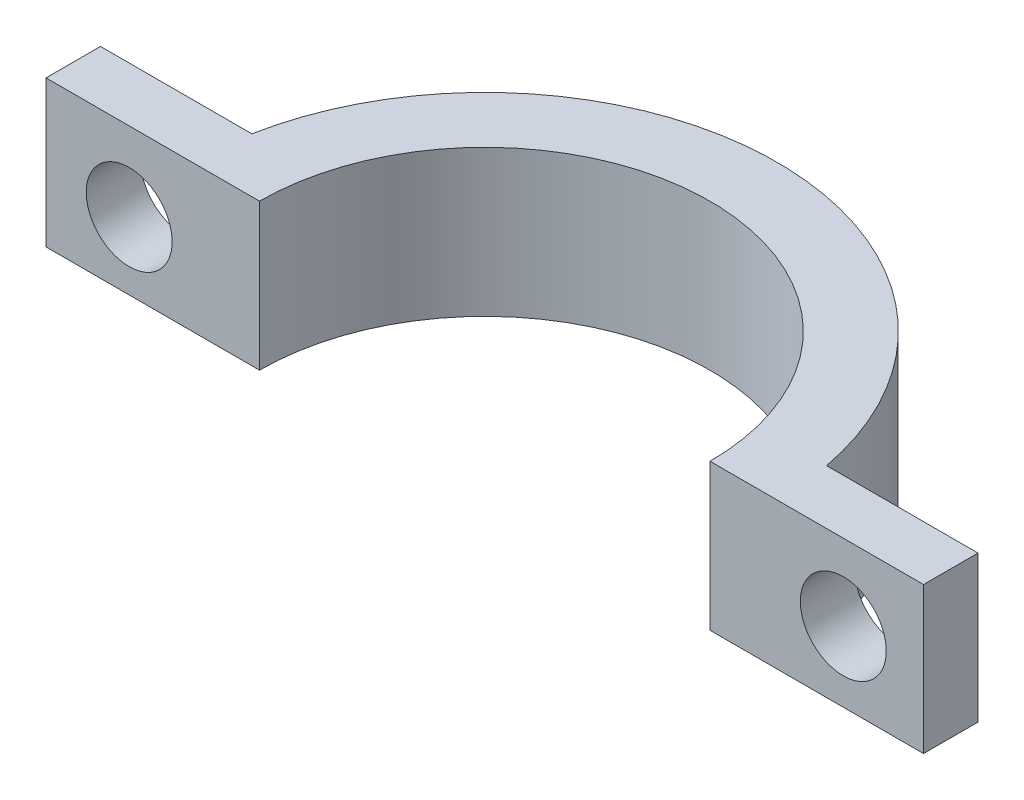
ISO-10303-21;
HEADER;
FILE_DESCRIPTION(('STEP AP214'),'2;1');
FILE_NAME('part.step','',(''),(''),'','','');
FILE_SCHEMA(('AUTOMOTIVE_DESIGN { 1 0 10303 214 1 1 1 1 }'));
ENDSEC;
DATA;
#1=APPLICATION_CONTEXT('core data for automotive mechanical design processes');
#2=APPLICATION_PROTOCOL_DEFINITION('international standard','automotive_design',2000,#1);
#3=PRODUCT_CONTEXT('',#1,'mechanical');
#4=PRODUCT('Part','Part','',(#3));
#5=PRODUCT_RELATED_PRODUCT_CATEGORY('part','',(#4));
#6=PRODUCT_DEFINITION_FORMATION('','',#4);
#7=PRODUCT_DEFINITION_CONTEXT('part definition',#1,'design');
#8=PRODUCT_DEFINITION('design','',#6,#7);
#9=PRODUCT_DEFINITION_SHAPE('','',#8);
#10=(LENGTH_UNIT() NAMED_UNIT(*) SI_UNIT(.MILLI.,.METRE.));
#11=(NAMED_UNIT(*) PLANE_ANGLE_UNIT() SI_UNIT($,.RADIAN.));
#12=(NAMED_UNIT(*) SI_UNIT($,.STERADIAN.) SOLID_ANGLE_UNIT());
#13=UNCERTAINTY_MEASURE_WITH_UNIT(LENGTH_MEASURE(1.E-05),#10,'distance_accuracy_value','');
#14=(GEOMETRIC_REPRESENTATION_CONTEXT(3) GLOBAL_UNCERTAINTY_ASSIGNED_CONTEXT((#13)) GLOBAL_UNIT_ASSIGNED_CONTEXT((#10,
#11,#12)) REPRESENTATION_CONTEXT('',''));
#15=CARTESIAN_POINT('',(0.,0.,0.));
#16=DIRECTION('',(0.,0.,1.));
#17=DIRECTION('',(1.,0.,0.));
#18=AXIS2_PLACEMENT_3D('',#15,#16,#17);
#19=CARTESIAN_POINT('',(0.,13.,-6.68253351351916));
#20=DIRECTION('',(0.,0.,1.));
#21=DIRECTION('',(1.,0.,0.));
#22=AXIS2_PLACEMENT_3D('',#19,#20,#21);
#23=PLANE('',#22);
#24=CARTESIAN_POINT('',(31.8343552375313,6.23079263332781,-6.68253351351916));
#25=DIRECTION('',(0.,0.,-1.));
#26=DIRECTION('',(-1.,0.,0.));
#27=AXIS2_PLACEMENT_3D('',#24,#25,#26);
#28=CIRCLE('',#27,3.81432266995538);
#29=CARTESIAN_POINT('',(28.020032567576,6.23079263332781,-6.68253351351916));
#30=VERTEX_POINT('',#29);
#31=EDGE_CURVE('E174',#30,#30,#28,.T.);
#32=ORIENTED_EDGE('',*,*,#31,.F.);
#33=EDGE_LOOP('',(#32));
#34=FACE_BOUND('',#33,.T.);
#35=DIRECTION('',(-1.,0.,0.));
#36=VECTOR('',#35,1.);
#37=CARTESIAN_POINT('',(0.,0.,-6.68253351351916));
#38=LINE('',#37,#36);
#39=CARTESIAN_POINT('',(38.9573112724548,0.,-6.68253351351922));
#40=VERTEX_POINT('',#39);
#41=CARTESIAN_POINT('',(25.5153185359838,0.,-6.68253351351921));
#42=VERTEX_POINT('',#41);
#43=EDGE_CURVE('E137',#40,#42,#38,.T.);
#44=ORIENTED_EDGE('',*,*,#43,.T.);
#45=DIRECTION('',(0.,-1.,0.));
#46=VECTOR('',#45,1.);
#47=CARTESIAN_POINT('',(25.5153185359838,13.,-6.68253351351921));
#48=LINE('',#47,#46);
#49=CARTESIAN_POINT('',(25.5153185359838,13.,-6.68253351351921));
#50=VERTEX_POINT('',#49);
#51=EDGE_CURVE('E11',#50,#42,#48,.T.);
#52=ORIENTED_EDGE('',*,*,#51,.F.);
#53=DIRECTION('',(-1.,0.,0.));
#54=VECTOR('',#53,1.);
#55=CARTESIAN_POINT('',(0.,13.,-6.68253351351916));
#56=LINE('',#55,#54);
#57=CARTESIAN_POINT('',(38.9573112724548,13.,-6.68253351351922));
#58=VERTEX_POINT('',#57);
#59=EDGE_CURVE('E156',#58,#50,#56,.T.);
#60=ORIENTED_EDGE('',*,*,#59,.F.);
#61=DIRECTION('',(0.,-1.,0.));
#62=VECTOR('',#61,1.);
#63=CARTESIAN_POINT('',(38.9573112724548,13.,-6.68253351351922));
#64=LINE('',#63,#62);
#65=EDGE_CURVE('E56',#58,#40,#64,.T.);
#66=ORIENTED_EDGE('',*,*,#65,.T.);
#67=EDGE_LOOP('',(#44,#52,#60,#66));
#68=FACE_BOUND('',#67,.T.);
#69=ADVANCED_FACE('F38',(#34,#68),#23,.F.);
#70=CARTESIAN_POINT('',(3.5527136788005E-12,13.,-1.84551397913424));
#71=DIRECTION('',(0.,-1.,0.));
#72=DIRECTION('',(0.,0.,-1.));
#73=AXIS2_PLACEMENT_3D('',#70,#71,#72);
#74=CYLINDRICAL_SURFACE('',#73,25.9697562169644);
#75=CARTESIAN_POINT('',(3.5527136788005E-12,0.,-1.84551397913424));
#76=DIRECTION('',(0.,1.,0.));
#77=DIRECTION('',(0.,0.,1.));
#78=AXIS2_PLACEMENT_3D('',#75,#76,#77);
#79=CIRCLE('',#78,25.9697562169644);
#80=CARTESIAN_POINT('',(-25.5153185359768,0.,-6.68253351351921));
#81=VERTEX_POINT('',#80);
#82=EDGE_CURVE('E139',#42,#81,#79,.T.);
#83=ORIENTED_EDGE('',*,*,#82,.T.);
#84=DIRECTION('',(0.,-1.,0.));
#85=VECTOR('',#84,1.);
#86=CARTESIAN_POINT('',(-25.5153185359768,13.,-6.68253351351921));
#87=LINE('',#86,#85);
#88=CARTESIAN_POINT('',(-25.5153185359768,13.,-6.68253351351921));
#89=VERTEX_POINT('',#88);
#90=EDGE_CURVE('E47',#89,#81,#87,.T.);
#91=ORIENTED_EDGE('',*,*,#90,.F.);
#92=CARTESIAN_POINT('',(3.5527136788005E-12,13.,-1.84551397913424));
#93=DIRECTION('',(0.,1.,0.));
#94=DIRECTION('',(0.,0.,1.));
#95=AXIS2_PLACEMENT_3D('',#92,#93,#94);
#96=CIRCLE('',#95,25.9697562169644);
#97=EDGE_CURVE('E95',#50,#89,#96,.T.);
#98=ORIENTED_EDGE('',*,*,#97,.F.);
#99=ORIENTED_EDGE('',*,*,#51,.T.);
#100=EDGE_LOOP('',(#83,#91,#98,#99));
#101=FACE_BOUND('',#100,.T.);
#102=ADVANCED_FACE('F204',(#101),#74,.T.);
#103=CARTESIAN_POINT('',(0.,13.,-6.68253351351916));
#104=DIRECTION('',(0.,0.,-1.));
#105=DIRECTION('',(-1.,0.,0.));
#106=AXIS2_PLACEMENT_3D('',#103,#104,#105);
#107=PLANE('',#106);
#108=CARTESIAN_POINT('',(-31.5714140858423,5.99374611495051,-6.68253351351916));
#109=DIRECTION('',(0.,0.,-1.));
#110=DIRECTION('',(-1.,0.,0.));
#111=AXIS2_PLACEMENT_3D('',#108,#109,#110);
#112=CIRCLE('',#111,3.81432266995537);
#113=CARTESIAN_POINT('',(-35.3857367557977,5.99374611495051,-6.68253351351916));
#114=VERTEX_POINT('',#113);
#115=EDGE_CURVE('E166',#114,#114,#112,.T.);
#116=ORIENTED_EDGE('',*,*,#115,.F.);
#117=EDGE_LOOP('',(#116));
#118=FACE_BOUND('',#117,.T.);
#119=DIRECTION('',(1.,0.,0.));
#120=VECTOR('',#119,1.);
#121=CARTESIAN_POINT('',(0.,0.,-6.68253351351916));
#122=LINE('',#121,#120);
#123=CARTESIAN_POINT('',(-38.9573112724479,0.,-6.68253351351922));
#124=VERTEX_POINT('',#123);
#125=EDGE_CURVE('E143',#124,#81,#122,.T.);
#126=ORIENTED_EDGE('',*,*,#125,.F.);
#127=DIRECTION('',(0.,-1.,0.));
#128=VECTOR('',#127,1.);
#129=CARTESIAN_POINT('',(-38.9573112724479,13.,-6.68253351351922));
#130=LINE('',#129,#128);
#131=CARTESIAN_POINT('',(-38.9573112724479,13.,-6.68253351351922));
#132=VERTEX_POINT('',#131);
#133=EDGE_CURVE('E163',#132,#124,#130,.T.);
#134=ORIENTED_EDGE('',*,*,#133,.F.);
#135=DIRECTION('',(1.,0.,0.));
#136=VECTOR('',#135,1.);
#137=CARTESIAN_POINT('',(0.,13.,-6.68253351351916));
#138=LINE('',#137,#136);
#139=EDGE_CURVE('E179',#132,#89,#138,.T.);
#140=ORIENTED_EDGE('',*,*,#139,.T.);
#141=ORIENTED_EDGE('',*,*,#90,.T.);
#142=EDGE_LOOP('',(#126,#134,#140,#141));
#143=FACE_BOUND('',#142,.T.);
#144=ADVANCED_FACE('F209',(#118,#143),#107,.T.);
#145=CARTESIAN_POINT('',(-38.9573112724479,13.,0.));
#146=DIRECTION('',(1.,0.,0.));
#147=DIRECTION('',(0.,0.,-1.));
#148=AXIS2_PLACEMENT_3D('',#145,#146,#147);
#149=PLANE('',#148);
#150=DIRECTION('',(0.,0.,1.));
#151=VECTOR('',#150,1.);
#152=CARTESIAN_POINT('',(-38.9573112724479,0.,0.));
#153=LINE('',#152,#151);
#154=CARTESIAN_POINT('',(-38.9573112724479,0.,-1.84551397913424));
#155=VERTEX_POINT('',#154);
#156=EDGE_CURVE('E146',#124,#155,#153,.T.);
#157=ORIENTED_EDGE('',*,*,#156,.T.);
#158=DIRECTION('',(0.,-1.,0.));
#159=VECTOR('',#158,1.);
#160=CARTESIAN_POINT('',(-38.9573112724479,13.,-1.84551397913424));
#161=LINE('',#160,#159);
#162=CARTESIAN_POINT('',(-38.9573112724479,13.,-1.84551397913424));
#163=VERTEX_POINT('',#162);
#164=EDGE_CURVE('E160',#163,#155,#161,.T.);
#165=ORIENTED_EDGE('',*,*,#164,.F.);
#166=DIRECTION('',(0.,0.,1.));
#167=VECTOR('',#166,1.);
#168=CARTESIAN_POINT('',(-38.9573112724479,13.,0.));
#169=LINE('',#168,#167);
#170=EDGE_CURVE('E133',#132,#163,#169,.T.);
#171=ORIENTED_EDGE('',*,*,#170,.F.);
#172=ORIENTED_EDGE('',*,*,#133,.T.);
#173=EDGE_LOOP('',(#157,#165,#171,#172));
#174=FACE_BOUND('',#173,.T.);
#175=ADVANCED_FACE('F185',(#174),#149,.F.);
#176=CARTESIAN_POINT('',(0.,13.,-1.84551397913424));
#177=DIRECTION('',(0.,0.,-1.));
#178=DIRECTION('',(-1.,0.,0.));
#179=AXIS2_PLACEMENT_3D('',#176,#177,#178);
#180=PLANE('',#179);
#181=CARTESIAN_POINT('',(-31.5714140858423,5.99374611495051,-1.84551397913424));
#182=DIRECTION('',(0.,0.,-1.));
#183=DIRECTION('',(-1.,0.,0.));
#184=AXIS2_PLACEMENT_3D('',#181,#182,#183);
#185=CIRCLE('',#184,3.81432266995537);
#186=CARTESIAN_POINT('',(-35.3857367557977,5.99374611495051,-1.84551397913424));
#187=VERTEX_POINT('',#186);
#188=EDGE_CURVE('E140',#187,#187,#185,.T.);
#189=ORIENTED_EDGE('',*,*,#188,.T.);
#190=EDGE_LOOP('',(#189));
#191=FACE_BOUND('',#190,.T.);
#192=DIRECTION('',(1.,0.,0.));
#193=VECTOR('',#192,1.);
#194=CARTESIAN_POINT('',(0.,0.,-1.84551397913424));
#195=LINE('',#194,#193);
#196=CARTESIAN_POINT('',(-19.9999999999964,0.,-1.84551397913424));
#197=VERTEX_POINT('',#196);
#198=EDGE_CURVE('E148',#155,#197,#195,.T.);
#199=ORIENTED_EDGE('',*,*,#198,.T.);
#200=DIRECTION('',(0.,-1.,0.));
#201=VECTOR('',#200,1.);
#202=CARTESIAN_POINT('',(-19.9999999999964,13.,-1.84551397913424));
#203=LINE('',#202,#201);
#204=CARTESIAN_POINT('',(-19.9999999999964,13.,-1.84551397913424));
#205=VERTEX_POINT('',#204);
#206=EDGE_CURVE('E120',#205,#197,#203,.T.);
#207=ORIENTED_EDGE('',*,*,#206,.F.);
#208=DIRECTION('',(1.,0.,0.));
#209=VECTOR('',#208,1.);
#210=CARTESIAN_POINT('',(0.,13.,-1.84551397913424));
#211=LINE('',#210,#209);
#212=EDGE_CURVE('E128',#163,#205,#211,.T.);
#213=ORIENTED_EDGE('',*,*,#212,.F.);
#214=ORIENTED_EDGE('',*,*,#164,.T.);
#215=EDGE_LOOP('',(#199,#207,#213,#214));
#216=FACE_BOUND('',#215,.T.);
#217=ADVANCED_FACE('F189',(#191,#216),#180,.F.);
#218=CARTESIAN_POINT('',(3.5527136788005E-12,13.,-1.84551397913424));
#219=DIRECTION('',(0.,-1.,0.));
#220=DIRECTION('',(0.,0.,-1.));
#221=AXIS2_PLACEMENT_3D('',#218,#219,#220);
#222=CYLINDRICAL_SURFACE('',#221,19.9999999999999);
#223=CARTESIAN_POINT('',(3.5527136788005E-12,0.,-1.84551397913424));
#224=DIRECTION('',(0.,1.,0.));
#225=DIRECTION('',(0.,0.,1.));
#226=AXIS2_PLACEMENT_3D('',#223,#224,#225);
#227=CIRCLE('',#226,19.9999999999999);
#228=CARTESIAN_POINT('',(20.0000000000035,0.,-1.84551397913424));
#229=VERTEX_POINT('',#228);
#230=EDGE_CURVE('E117',#229,#197,#227,.T.);
#231=ORIENTED_EDGE('',*,*,#230,.F.);
#232=DIRECTION('',(0.,-1.,0.));
#233=VECTOR('',#232,1.);
#234=CARTESIAN_POINT('',(20.0000000000035,13.,-1.84551397913424));
#235=LINE('',#234,#233);
#236=CARTESIAN_POINT('',(20.0000000000035,13.,-1.84551397913424));
#237=VERTEX_POINT('',#236);
#238=EDGE_CURVE('E111',#237,#229,#235,.T.);
#239=ORIENTED_EDGE('',*,*,#238,.F.);
#240=CARTESIAN_POINT('',(3.5527136788005E-12,13.,-1.84551397913424));
#241=DIRECTION('',(0.,1.,0.));
#242=DIRECTION('',(0.,0.,1.));
#243=AXIS2_PLACEMENT_3D('',#240,#241,#242);
#244=CIRCLE('',#243,19.9999999999999);
#245=EDGE_CURVE('E115',#237,#205,#244,.T.);
#246=ORIENTED_EDGE('',*,*,#245,.T.);
#247=ORIENTED_EDGE('',*,*,#206,.T.);
#248=EDGE_LOOP('',(#231,#239,#246,#247));
#249=FACE_BOUND('',#248,.T.);
#250=ADVANCED_FACE('F113',(#249),#222,.F.);
#251=CARTESIAN_POINT('',(31.8343552375313,6.23079263332781,-1.84551397913424));
#252=DIRECTION('',(0.,0.,-1.));
#253=DIRECTION('',(-1.,0.,0.));
#254=AXIS2_PLACEMENT_3D('',#251,#252,#253);
#255=CIRCLE('',#254,3.81432266995538);
#256=CARTESIAN_POINT('',(28.020032567576,6.23079263332781,-1.84551397913424));
#257=VERTEX_POINT('',#256);
#258=EDGE_CURVE('E41',#257,#257,#255,.T.);
#259=ORIENTED_EDGE('',*,*,#258,.T.);
#260=EDGE_LOOP('',(#259));
#261=FACE_BOUND('',#260,.T.);
#262=CARTESIAN_POINT('',(38.9573112724548,0.,-1.84551397913424));
#263=VERTEX_POINT('',#262);
#264=EDGE_CURVE('E151',#229,#263,#195,.T.);
#265=ORIENTED_EDGE('',*,*,#264,.T.);
#266=DIRECTION('',(0.,-1.,0.));
#267=VECTOR('',#266,1.);
#268=CARTESIAN_POINT('',(38.9573112724548,13.,-1.84551397913424));
#269=LINE('',#268,#267);
#270=CARTESIAN_POINT('',(38.9573112724548,13.,-1.84551397913424));
#271=VERTEX_POINT('',#270);
#272=EDGE_CURVE('E83',#271,#263,#269,.T.);
#273=ORIENTED_EDGE('',*,*,#272,.F.);
#274=EDGE_CURVE('E122',#237,#271,#211,.T.);
#275=ORIENTED_EDGE('',*,*,#274,.F.);
#276=ORIENTED_EDGE('',*,*,#238,.T.);
#277=EDGE_LOOP('',(#265,#273,#275,#276));
#278=FACE_BOUND('',#277,.T.);
#279=ADVANCED_FACE('F123',(#261,#278),#180,.F.);
#280=CARTESIAN_POINT('',(38.9573112724548,13.,0.));
#281=DIRECTION('',(1.,0.,0.));
#282=DIRECTION('',(0.,0.,-1.));
#283=AXIS2_PLACEMENT_3D('',#280,#281,#282);
#284=PLANE('',#283);
#285=DIRECTION('',(0.,0.,1.));
#286=VECTOR('',#285,1.);
#287=CARTESIAN_POINT('',(38.9573112724548,0.,0.));
#288=LINE('',#287,#286);
#289=EDGE_CURVE('E153',#40,#263,#288,.T.);
#290=ORIENTED_EDGE('',*,*,#289,.F.);
#291=ORIENTED_EDGE('',*,*,#65,.F.);
#292=DIRECTION('',(0.,0.,1.));
#293=VECTOR('',#292,1.);
#294=CARTESIAN_POINT('',(38.9573112724548,13.,0.));
#295=LINE('',#294,#293);
#296=EDGE_CURVE('E126',#58,#271,#295,.T.);
#297=ORIENTED_EDGE('',*,*,#296,.T.);
#298=ORIENTED_EDGE('',*,*,#272,.T.);
#299=EDGE_LOOP('',(#290,#291,#297,#298));
#300=FACE_BOUND('',#299,.T.);
#301=ADVANCED_FACE('F192',(#300),#284,.T.);
#302=CARTESIAN_POINT('',(0.,13.,0.));
#303=DIRECTION('',(0.,1.,0.));
#304=DIRECTION('',(0.,0.,1.));
#305=AXIS2_PLACEMENT_3D('',#302,#303,#304);
#306=PLANE('',#305);
#307=ORIENTED_EDGE('',*,*,#59,.T.);
#308=ORIENTED_EDGE('',*,*,#97,.T.);
#309=ORIENTED_EDGE('',*,*,#139,.F.);
#310=ORIENTED_EDGE('',*,*,#170,.T.);
#311=ORIENTED_EDGE('',*,*,#212,.T.);
#312=ORIENTED_EDGE('',*,*,#245,.F.);
#313=ORIENTED_EDGE('',*,*,#274,.T.);
#314=ORIENTED_EDGE('',*,*,#296,.F.);
#315=EDGE_LOOP('',(#307,#308,#309,#310,#311,#312,#313,#314));
#316=FACE_BOUND('',#315,.T.);
#317=ADVANCED_FACE('F129',(#316),#306,.T.);
#318=CARTESIAN_POINT('',(0.,0.,0.));
#319=DIRECTION('',(0.,1.,0.));
#320=DIRECTION('',(0.,0.,1.));
#321=AXIS2_PLACEMENT_3D('',#318,#319,#320);
#322=PLANE('',#321);
#323=ORIENTED_EDGE('',*,*,#43,.F.);
#324=ORIENTED_EDGE('',*,*,#289,.T.);
#325=ORIENTED_EDGE('',*,*,#264,.F.);
#326=ORIENTED_EDGE('',*,*,#230,.T.);
#327=ORIENTED_EDGE('',*,*,#198,.F.);
#328=ORIENTED_EDGE('',*,*,#156,.F.);
#329=ORIENTED_EDGE('',*,*,#125,.T.);
#330=ORIENTED_EDGE('',*,*,#82,.F.);
#331=EDGE_LOOP('',(#323,#324,#325,#326,#327,#328,#329,#330));
#332=FACE_BOUND('',#331,.T.);
#333=ADVANCED_FACE('F191',(#332),#322,.F.);
#334=CARTESIAN_POINT('',(-31.5714140858423,5.99374611495051,6.31746648648084));
#335=DIRECTION('',(0.,0.,-1.));
#336=DIRECTION('',(-1.,0.,0.));
#337=AXIS2_PLACEMENT_3D('',#334,#335,#336);
#338=CYLINDRICAL_SURFACE('',#337,3.81432266995537);
#339=ORIENTED_EDGE('',*,*,#115,.T.);
#340=EDGE_LOOP('',(#339));
#341=FACE_BOUND('',#340,.T.);
#342=ORIENTED_EDGE('',*,*,#188,.F.);
#343=EDGE_LOOP('',(#342));
#344=FACE_BOUND('',#343,.T.);
#345=ADVANCED_FACE('F261',(#341,#344),#338,.F.);
#346=CARTESIAN_POINT('',(31.8343552375313,6.23079263332781,6.31746648648084));
#347=DIRECTION('',(0.,0.,-1.));
#348=DIRECTION('',(-1.,0.,0.));
#349=AXIS2_PLACEMENT_3D('',#346,#347,#348);
#350=CYLINDRICAL_SURFACE('',#349,3.81432266995538);
#351=ORIENTED_EDGE('',*,*,#31,.T.);
#352=EDGE_LOOP('',(#351));
#353=FACE_BOUND('',#352,.T.);
#354=ORIENTED_EDGE('',*,*,#258,.F.);
#355=EDGE_LOOP('',(#354));
#356=FACE_BOUND('',#355,.T.);
#357=ADVANCED_FACE('F285',(#353,#356),#350,.F.);
#358=CLOSED_SHELL('',(#69,#102,#144,#175,#217,#250,#279,#301,#317,#333,#345,#357));
#359=MANIFOLD_SOLID_BREP('B2',#358);
#360=ADVANCED_BREP_SHAPE_REPRESENTATION('',(#18,#359),#14);
#361=SHAPE_DEFINITION_REPRESENTATION(#9,#360);
ENDSEC;
END-ISO-10303-21;
